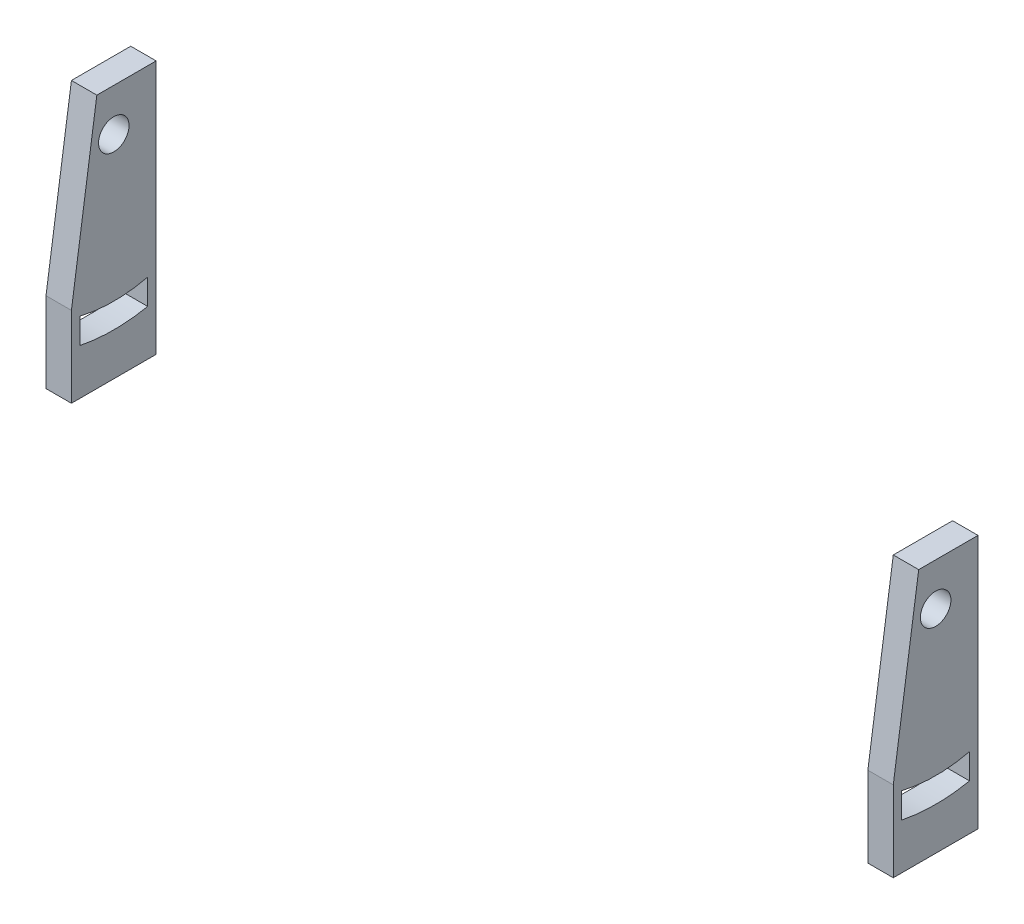
ISO-10303-21;
HEADER;
FILE_DESCRIPTION(('STEP AP214'),'2;1');
FILE_NAME('part.step','',(''),(''),'','','');
FILE_SCHEMA(('AUTOMOTIVE_DESIGN { 1 0 10303 214 1 1 1 1 }'));
ENDSEC;
DATA;
#1=APPLICATION_CONTEXT('core data for automotive mechanical design processes');
#2=APPLICATION_PROTOCOL_DEFINITION('international standard','automotive_design',2000,#1);
#3=PRODUCT_CONTEXT('',#1,'mechanical');
#4=PRODUCT('Part','Part','',(#3));
#5=PRODUCT_RELATED_PRODUCT_CATEGORY('part','',(#4));
#6=PRODUCT_DEFINITION_FORMATION('','',#4);
#7=PRODUCT_DEFINITION_CONTEXT('part definition',#1,'design');
#8=PRODUCT_DEFINITION('design','',#6,#7);
#9=PRODUCT_DEFINITION_SHAPE('','',#8);
#10=(LENGTH_UNIT() NAMED_UNIT(*) SI_UNIT(.MILLI.,.METRE.));
#11=(NAMED_UNIT(*) PLANE_ANGLE_UNIT() SI_UNIT($,.RADIAN.));
#12=(NAMED_UNIT(*) SI_UNIT($,.STERADIAN.) SOLID_ANGLE_UNIT());
#13=UNCERTAINTY_MEASURE_WITH_UNIT(LENGTH_MEASURE(1.E-05),#10,'distance_accuracy_value','');
#14=(GEOMETRIC_REPRESENTATION_CONTEXT(3) GLOBAL_UNCERTAINTY_ASSIGNED_CONTEXT((#13)) GLOBAL_UNIT_ASSIGNED_CONTEXT((#10,
#11,#12)) REPRESENTATION_CONTEXT('',''));
#15=CARTESIAN_POINT('',(0.,0.,0.));
#16=DIRECTION('',(0.,0.,1.));
#17=DIRECTION('',(1.,0.,0.));
#18=AXIS2_PLACEMENT_3D('',#15,#16,#17);
#19=CARTESIAN_POINT('',(100.,16.5321368936025,11.9084263256568));
#20=DIRECTION('',(0.,0.,-1.));
#21=DIRECTION('',(0.,1.,0.));
#22=AXIS2_PLACEMENT_3D('',#19,#20,#21);
#23=PLANE('',#22);
#24=DIRECTION('',(0.,1.,0.));
#25=VECTOR('',#24,1.);
#26=CARTESIAN_POINT('',(3.,-83.4678631063975,11.9084263256568));
#27=LINE('',#26,#25);
#28=CARTESIAN_POINT('',(3.,-13.4678631063975,11.9084263256568));
#29=VERTEX_POINT('',#28);
#30=CARTESIAN_POINT('',(3.,-3.96786310639754,11.9084263256568));
#31=VERTEX_POINT('',#30);
#32=EDGE_CURVE('E151',#29,#31,#27,.T.);
#33=ORIENTED_EDGE('',*,*,#32,.T.);
#34=DIRECTION('',(-1.,0.,0.));
#35=VECTOR('',#34,1.);
#36=CARTESIAN_POINT('',(100.,-3.9678631063975,11.9084263256568));
#37=LINE('',#36,#35);
#38=CARTESIAN_POINT('',(0.,-3.9678631063975,11.9084263256568));
#39=VERTEX_POINT('',#38);
#40=EDGE_CURVE('E57',#31,#39,#37,.T.);
#41=ORIENTED_EDGE('',*,*,#40,.T.);
#42=DIRECTION('',(0.,-1.,0.));
#43=VECTOR('',#42,1.);
#44=CARTESIAN_POINT('',(0.,16.5321368936025,11.9084263256568));
#45=LINE('',#44,#43);
#46=CARTESIAN_POINT('',(0.,-13.4678631063975,11.9084263256568));
#47=VERTEX_POINT('',#46);
#48=EDGE_CURVE('E127',#39,#47,#45,.T.);
#49=ORIENTED_EDGE('',*,*,#48,.T.);
#50=DIRECTION('',(-1.,0.,0.));
#51=VECTOR('',#50,1.);
#52=CARTESIAN_POINT('',(100.,-13.4678631063975,11.9084263256568));
#53=LINE('',#52,#51);
#54=EDGE_CURVE('E148',#29,#47,#53,.T.);
#55=ORIENTED_EDGE('',*,*,#54,.F.);
#56=EDGE_LOOP('',(#33,#41,#49,#55));
#57=FACE_BOUND('',#56,.T.);
#58=ADVANCED_FACE('F43',(#57),#23,.F.);
#59=CARTESIAN_POINT('',(100.,-13.4678631063975,11.9084263256568));
#60=DIRECTION('',(0.,1.,0.));
#61=DIRECTION('',(0.,0.,1.));
#62=AXIS2_PLACEMENT_3D('',#59,#60,#61);
#63=PLANE('',#62);
#64=DIRECTION('',(-1.,0.,0.));
#65=VECTOR('',#64,1.);
#66=CARTESIAN_POINT('',(100.,-13.4678631063975,1.90842632565675));
#67=LINE('',#66,#65);
#68=CARTESIAN_POINT('',(3.,-13.4678631063975,1.90842632565675));
#69=VERTEX_POINT('',#68);
#70=CARTESIAN_POINT('',(0.,-13.4678631063975,1.90842632565675));
#71=VERTEX_POINT('',#70);
#72=EDGE_CURVE('E144',#69,#71,#67,.T.);
#73=ORIENTED_EDGE('',*,*,#72,.F.);
#74=DIRECTION('',(0.,0.,1.));
#75=VECTOR('',#74,1.);
#76=CARTESIAN_POINT('',(3.,-13.4678631063975,11.9084263256568));
#77=LINE('',#76,#75);
#78=EDGE_CURVE('E150',#69,#29,#77,.T.);
#79=ORIENTED_EDGE('',*,*,#78,.T.);
#80=ORIENTED_EDGE('',*,*,#54,.T.);
#81=DIRECTION('',(0.,0.,-1.));
#82=VECTOR('',#81,1.);
#83=CARTESIAN_POINT('',(0.,-13.4678631063975,11.9084263256568));
#84=LINE('',#83,#82);
#85=EDGE_CURVE('E145',#47,#71,#84,.T.);
#86=ORIENTED_EDGE('',*,*,#85,.T.);
#87=EDGE_LOOP('',(#73,#79,#80,#86));
#88=FACE_BOUND('',#87,.T.);
#89=ADVANCED_FACE('F211',(#88),#63,.F.);
#90=CARTESIAN_POINT('',(100.,16.5321368936025,1.90842632565675));
#91=DIRECTION('',(0.,0.,1.));
#92=DIRECTION('',(1.,0.,0.));
#93=AXIS2_PLACEMENT_3D('',#90,#91,#92);
#94=PLANE('',#93);
#95=DIRECTION('',(-1.,0.,0.));
#96=VECTOR('',#95,1.);
#97=CARTESIAN_POINT('',(100.,16.5321368936025,1.90842632565675));
#98=LINE('',#97,#96);
#99=CARTESIAN_POINT('',(3.,16.5321368936025,1.90842632565675));
#100=VERTEX_POINT('',#99);
#101=CARTESIAN_POINT('',(0.,16.5321368936025,1.90842632565675));
#102=VERTEX_POINT('',#101);
#103=EDGE_CURVE('E131',#100,#102,#98,.T.);
#104=ORIENTED_EDGE('',*,*,#103,.F.);
#105=DIRECTION('',(0.,1.,0.));
#106=VECTOR('',#105,1.);
#107=CARTESIAN_POINT('',(3.,-83.4678631063975,1.90842632565675));
#108=LINE('',#107,#106);
#109=EDGE_CURVE('E133',#69,#100,#108,.T.);
#110=ORIENTED_EDGE('',*,*,#109,.F.);
#111=ORIENTED_EDGE('',*,*,#72,.T.);
#112=DIRECTION('',(0.,1.,0.));
#113=VECTOR('',#112,1.);
#114=CARTESIAN_POINT('',(0.,16.5321368936025,1.90842632565675));
#115=LINE('',#114,#113);
#116=EDGE_CURVE('E137',#71,#102,#115,.T.);
#117=ORIENTED_EDGE('',*,*,#116,.T.);
#118=EDGE_LOOP('',(#104,#110,#111,#117));
#119=FACE_BOUND('',#118,.T.);
#120=ADVANCED_FACE('F213',(#119),#94,.F.);
#121=CARTESIAN_POINT('',(100.,16.5321368936025,11.9084263256568));
#122=DIRECTION('',(0.,-1.,0.));
#123=DIRECTION('',(0.,0.,-1.));
#124=AXIS2_PLACEMENT_3D('',#121,#122,#123);
#125=PLANE('',#124);
#126=DIRECTION('',(0.,0.,1.));
#127=VECTOR('',#126,1.);
#128=CARTESIAN_POINT('',(0.,16.5321368936025,11.9084263256568));
#129=LINE('',#128,#127);
#130=CARTESIAN_POINT('',(0.,16.5321368936025,8.90842632565676));
#131=VERTEX_POINT('',#130);
#132=EDGE_CURVE('E125',#102,#131,#129,.T.);
#133=ORIENTED_EDGE('',*,*,#132,.T.);
#134=DIRECTION('',(-1.,0.,0.));
#135=VECTOR('',#134,1.);
#136=CARTESIAN_POINT('',(100.,16.5321368936025,8.90842632565676));
#137=LINE('',#136,#135);
#138=CARTESIAN_POINT('',(3.,16.5321368936025,8.90842632565676));
#139=VERTEX_POINT('',#138);
#140=EDGE_CURVE('E111',#139,#131,#137,.T.);
#141=ORIENTED_EDGE('',*,*,#140,.F.);
#142=DIRECTION('',(0.,0.,1.));
#143=VECTOR('',#142,1.);
#144=CARTESIAN_POINT('',(3.,16.5321368936025,11.9084263256568));
#145=LINE('',#144,#143);
#146=EDGE_CURVE('E135',#100,#139,#145,.T.);
#147=ORIENTED_EDGE('',*,*,#146,.F.);
#148=ORIENTED_EDGE('',*,*,#103,.T.);
#149=EDGE_LOOP('',(#133,#141,#147,#148));
#150=FACE_BOUND('',#149,.T.);
#151=ADVANCED_FACE('F129',(#150),#125,.F.);
#152=CARTESIAN_POINT('',(0.,0.,0.));
#153=DIRECTION('',(1.,0.,0.));
#154=DIRECTION('',(0.,0.,-1.));
#155=AXIS2_PLACEMENT_3D('',#152,#153,#154);
#156=PLANE('',#155);
#157=DIRECTION('',(0.,-1.,0.));
#158=VECTOR('',#157,1.);
#159=CARTESIAN_POINT('',(0.,-5.06378104866293,10.9084263256568));
#160=LINE('',#159,#158);
#161=CARTESIAN_POINT('',(0.,-5.06378104866293,10.9084263256567));
#162=VERTEX_POINT('',#161);
#163=CARTESIAN_POINT('',(0.,-8.06378104866293,10.9084263256568));
#164=VERTEX_POINT('',#163);
#165=EDGE_CURVE('E195',#162,#164,#160,.T.);
#166=ORIENTED_EDGE('',*,*,#165,.T.);
#167=CARTESIAN_POINT('',(0.,11.5321368936025,6.90842632565675));
#168=DIRECTION('',(1.,0.,0.));
#169=DIRECTION('',(0.,0.,1.));
#170=AXIS2_PLACEMENT_3D('',#167,#168,#169);
#171=CIRCLE('',#170,20.);
#172=CARTESIAN_POINT('',(0.,-8.06378104866293,2.90842632565675));
#173=VERTEX_POINT('',#172);
#174=EDGE_CURVE('E184',#164,#173,#171,.T.);
#175=ORIENTED_EDGE('',*,*,#174,.T.);
#176=DIRECTION('',(0.,0.99999967058035,0.000811689097765342));
#177=VECTOR('',#176,1.);
#178=CARTESIAN_POINT('',(0.,-5.06436765268107,2.91086091761197));
#179=LINE('',#178,#177);
#180=CARTESIAN_POINT('',(0.,-5.06436765268107,2.91086091761197));
#181=VERTEX_POINT('',#180);
#182=EDGE_CURVE('E200',#173,#181,#179,.T.);
#183=ORIENTED_EDGE('',*,*,#182,.T.);
#184=CARTESIAN_POINT('',(0.,11.5321368936025,6.90842632565675));
#185=DIRECTION('',(-1.,0.,0.));
#186=DIRECTION('',(0.,0.,1.));
#187=AXIS2_PLACEMENT_3D('',#184,#185,#186);
#188=CIRCLE('',#187,17.0711596661272);
#189=EDGE_CURVE('E64',#181,#162,#188,.T.);
#190=ORIENTED_EDGE('',*,*,#189,.T.);
#191=EDGE_LOOP('',(#166,#175,#183,#190));
#192=FACE_BOUND('',#191,.T.);
#193=CARTESIAN_POINT('',(0.,11.5321368936025,6.90842632565675));
#194=DIRECTION('',(1.,0.,0.));
#195=DIRECTION('',(0.,0.,-1.));
#196=AXIS2_PLACEMENT_3D('',#193,#194,#195);
#197=CIRCLE('',#196,1.80000000000045);
#198=CARTESIAN_POINT('',(0.,11.5321368936025,5.1084263256563));
#199=VERTEX_POINT('',#198);
#200=EDGE_CURVE('E141',#199,#199,#197,.T.);
#201=ORIENTED_EDGE('',*,*,#200,.T.);
#202=EDGE_LOOP('',(#201));
#203=FACE_BOUND('',#202,.T.);
#204=ORIENTED_EDGE('',*,*,#48,.F.);
#205=DIRECTION('',(0.,-0.989461064134103,0.144799180117186));
#206=VECTOR('',#205,1.);
#207=CARTESIAN_POINT('',(0.,16.5321368936025,8.90842632565676));
#208=LINE('',#207,#206);
#209=EDGE_CURVE('E114',#131,#39,#208,.T.);
#210=ORIENTED_EDGE('',*,*,#209,.F.);
#211=ORIENTED_EDGE('',*,*,#132,.F.);
#212=ORIENTED_EDGE('',*,*,#116,.F.);
#213=ORIENTED_EDGE('',*,*,#85,.F.);
#214=EDGE_LOOP('',(#204,#210,#211,#212,#213));
#215=FACE_BOUND('',#214,.T.);
#216=ADVANCED_FACE('F123',(#192,#203,#215),#156,.F.);
#217=CARTESIAN_POINT('',(3.,-83.4678631063975,11.9084263256568));
#218=DIRECTION('',(-1.,0.,0.));
#219=DIRECTION('',(0.,0.,1.));
#220=AXIS2_PLACEMENT_3D('',#217,#218,#219);
#221=PLANE('',#220);
#222=DIRECTION('',(0.,-0.99999967058035,-0.000811689097765342));
#223=VECTOR('',#222,1.);
#224=CARTESIAN_POINT('',(3.,-83.4605082277596,2.84722760403823));
#225=LINE('',#224,#223);
#226=CARTESIAN_POINT('',(3.,-5.06436765268107,2.91086091761197));
#227=VERTEX_POINT('',#226);
#228=CARTESIAN_POINT('',(3.,-8.06378104866293,2.90842632565675));
#229=VERTEX_POINT('',#228);
#230=EDGE_CURVE('E158',#227,#229,#225,.T.);
#231=ORIENTED_EDGE('',*,*,#230,.T.);
#232=CARTESIAN_POINT('',(3.,11.5321368936025,6.90842632565675));
#233=DIRECTION('',(-1.,0.,0.));
#234=DIRECTION('',(0.,0.,1.));
#235=AXIS2_PLACEMENT_3D('',#232,#233,#234);
#236=CIRCLE('',#235,20.);
#237=CARTESIAN_POINT('',(3.,-8.06378104866293,10.9084263256568));
#238=VERTEX_POINT('',#237);
#239=EDGE_CURVE('E50',#229,#238,#236,.T.);
#240=ORIENTED_EDGE('',*,*,#239,.T.);
#241=DIRECTION('',(0.,1.,0.));
#242=VECTOR('',#241,1.);
#243=CARTESIAN_POINT('',(3.,-83.4678631063975,10.9084263256568));
#244=LINE('',#243,#242);
#245=CARTESIAN_POINT('',(3.,-5.06378104866293,10.9084263256567));
#246=VERTEX_POINT('',#245);
#247=EDGE_CURVE('E169',#238,#246,#244,.T.);
#248=ORIENTED_EDGE('',*,*,#247,.T.);
#249=CARTESIAN_POINT('',(3.,11.5321368936025,6.90842632565675));
#250=DIRECTION('',(-1.,0.,0.));
#251=DIRECTION('',(0.,0.,1.));
#252=AXIS2_PLACEMENT_3D('',#249,#250,#251);
#253=CIRCLE('',#252,17.0711596661272);
#254=EDGE_CURVE('E166',#246,#227,#253,.F.);
#255=ORIENTED_EDGE('',*,*,#254,.T.);
#256=EDGE_LOOP('',(#231,#240,#248,#255));
#257=FACE_BOUND('',#256,.T.);
#258=CARTESIAN_POINT('',(3.,11.5321368936025,6.90842632565675));
#259=DIRECTION('',(-1.,0.,0.));
#260=DIRECTION('',(0.,0.,1.));
#261=AXIS2_PLACEMENT_3D('',#258,#259,#260);
#262=CIRCLE('',#261,1.80000000000045);
#263=CARTESIAN_POINT('',(3.,11.5321368936025,8.70842632565721));
#264=VERTEX_POINT('',#263);
#265=EDGE_CURVE('E155',#264,#264,#262,.T.);
#266=ORIENTED_EDGE('',*,*,#265,.T.);
#267=EDGE_LOOP('',(#266));
#268=FACE_BOUND('',#267,.T.);
#269=ORIENTED_EDGE('',*,*,#146,.T.);
#270=DIRECTION('',(0.,-0.989461064134103,0.144799180117186));
#271=VECTOR('',#270,1.);
#272=CARTESIAN_POINT('',(3.,-81.8010023026701,23.2986418177942));
#273=LINE('',#272,#271);
#274=EDGE_CURVE('E12',#139,#31,#273,.T.);
#275=ORIENTED_EDGE('',*,*,#274,.T.);
#276=ORIENTED_EDGE('',*,*,#32,.F.);
#277=ORIENTED_EDGE('',*,*,#78,.F.);
#278=ORIENTED_EDGE('',*,*,#109,.T.);
#279=EDGE_LOOP('',(#269,#275,#276,#277,#278));
#280=FACE_BOUND('',#279,.T.);
#281=ADVANCED_FACE('F174',(#257,#268,#280),#221,.F.);
#282=CARTESIAN_POINT('',(0.,11.5321368936025,6.90842632565675));
#283=DIRECTION('',(1.,0.,0.));
#284=DIRECTION('',(0.,0.,-1.));
#285=AXIS2_PLACEMENT_3D('',#282,#283,#284);
#286=CYLINDRICAL_SURFACE('',#285,1.80000000000045);
#287=ORIENTED_EDGE('',*,*,#200,.F.);
#288=EDGE_LOOP('',(#287));
#289=FACE_BOUND('',#288,.T.);
#290=ORIENTED_EDGE('',*,*,#265,.F.);
#291=EDGE_LOOP('',(#290));
#292=FACE_BOUND('',#291,.T.);
#293=ADVANCED_FACE('F240',(#289,#292),#286,.F.);
#294=CARTESIAN_POINT('',(0.,11.5321368936025,6.90842632565675));
#295=DIRECTION('',(1.,0.,0.));
#296=DIRECTION('',(0.,0.,-1.));
#297=AXIS2_PLACEMENT_3D('',#294,#295,#296);
#298=CYLINDRICAL_SURFACE('',#297,20.);
#299=DIRECTION('',(1.,0.,0.));
#300=VECTOR('',#299,1.);
#301=CARTESIAN_POINT('',(0.,-8.06378104866293,2.90842632565675));
#302=LINE('',#301,#300);
#303=EDGE_CURVE('E180',#173,#229,#302,.T.);
#304=ORIENTED_EDGE('',*,*,#303,.F.);
#305=ORIENTED_EDGE('',*,*,#174,.F.);
#306=DIRECTION('',(1.,0.,0.));
#307=VECTOR('',#306,1.);
#308=CARTESIAN_POINT('',(0.,-8.06378104866293,10.9084263256568));
#309=LINE('',#308,#307);
#310=EDGE_CURVE('E182',#164,#238,#309,.T.);
#311=ORIENTED_EDGE('',*,*,#310,.T.);
#312=ORIENTED_EDGE('',*,*,#239,.F.);
#313=EDGE_LOOP('',(#304,#305,#311,#312));
#314=FACE_BOUND('',#313,.T.);
#315=ADVANCED_FACE('F178',(#314),#298,.F.);
#316=CARTESIAN_POINT('',(0.,-5.06378104866293,10.9084263256568));
#317=DIRECTION('',(0.,0.,1.));
#318=DIRECTION('',(1.,0.,0.));
#319=AXIS2_PLACEMENT_3D('',#316,#317,#318);
#320=PLANE('',#319);
#321=ORIENTED_EDGE('',*,*,#310,.F.);
#322=ORIENTED_EDGE('',*,*,#165,.F.);
#323=DIRECTION('',(1.,0.,0.));
#324=VECTOR('',#323,1.);
#325=CARTESIAN_POINT('',(0.,-5.06378104866293,10.9084263256567));
#326=LINE('',#325,#324);
#327=EDGE_CURVE('E188',#162,#246,#326,.T.);
#328=ORIENTED_EDGE('',*,*,#327,.T.);
#329=ORIENTED_EDGE('',*,*,#247,.F.);
#330=EDGE_LOOP('',(#321,#322,#328,#329));
#331=FACE_BOUND('',#330,.T.);
#332=ADVANCED_FACE('F256',(#331),#320,.F.);
#333=CARTESIAN_POINT('',(0.,11.5321368936025,6.90842632565675));
#334=DIRECTION('',(1.,0.,0.));
#335=DIRECTION('',(0.,0.,-1.));
#336=AXIS2_PLACEMENT_3D('',#333,#334,#335);
#337=CYLINDRICAL_SURFACE('',#336,17.0711596661272);
#338=ORIENTED_EDGE('',*,*,#327,.F.);
#339=ORIENTED_EDGE('',*,*,#189,.F.);
#340=DIRECTION('',(1.,0.,0.));
#341=VECTOR('',#340,1.);
#342=CARTESIAN_POINT('',(0.,-5.06436765268107,2.91086091761197));
#343=LINE('',#342,#341);
#344=EDGE_CURVE('E192',#181,#227,#343,.T.);
#345=ORIENTED_EDGE('',*,*,#344,.T.);
#346=ORIENTED_EDGE('',*,*,#254,.F.);
#347=EDGE_LOOP('',(#338,#339,#345,#346));
#348=FACE_BOUND('',#347,.T.);
#349=ADVANCED_FACE('F265',(#348),#337,.T.);
#350=CARTESIAN_POINT('',(0.,-5.06436765268107,2.91086091761197));
#351=DIRECTION('',(0.,0.000811689097765342,-0.99999967058035));
#352=DIRECTION('',(0.,0.99999967058035,0.000811689097765342));
#353=AXIS2_PLACEMENT_3D('',#350,#351,#352);
#354=PLANE('',#353);
#355=ORIENTED_EDGE('',*,*,#344,.F.);
#356=ORIENTED_EDGE('',*,*,#182,.F.);
#357=ORIENTED_EDGE('',*,*,#303,.T.);
#358=ORIENTED_EDGE('',*,*,#230,.F.);
#359=EDGE_LOOP('',(#355,#356,#357,#358));
#360=FACE_BOUND('',#359,.T.);
#361=ADVANCED_FACE('F273',(#360),#354,.F.);
#362=CARTESIAN_POINT('',(100.,16.5321368936025,8.90842632565676));
#363=DIRECTION('',(0.,-0.144799180117186,-0.989461064134103));
#364=DIRECTION('',(0.,0.989461064134103,-0.144799180117186));
#365=AXIS2_PLACEMENT_3D('',#362,#363,#364);
#366=PLANE('',#365);
#367=ORIENTED_EDGE('',*,*,#140,.T.);
#368=ORIENTED_EDGE('',*,*,#209,.T.);
#369=ORIENTED_EDGE('',*,*,#40,.F.);
#370=ORIENTED_EDGE('',*,*,#274,.F.);
#371=EDGE_LOOP('',(#367,#368,#369,#370));
#372=FACE_BOUND('',#371,.T.);
#373=ADVANCED_FACE('F113',(#372),#366,.F.);
#374=CLOSED_SHELL('',(#58,#89,#120,#151,#216,#281,#293,#315,#332,#349,#361,#373));
#375=MANIFOLD_SOLID_BREP('B2',#374);
#376=CARTESIAN_POINT('',(100.,0.,0.));
#377=DIRECTION('',(1.,0.,0.));
#378=DIRECTION('',(0.,0.,-1.));
#379=AXIS2_PLACEMENT_3D('',#376,#377,#378);
#380=PLANE('',#379);
#381=DIRECTION('',(0.,-0.989461064134103,0.144799180117186));
#382=VECTOR('',#381,1.);
#383=CARTESIAN_POINT('',(100.,16.5321368936025,8.90842632565676));
#384=LINE('',#383,#382);
#385=CARTESIAN_POINT('',(100.,16.5321368936025,8.90842632565676));
#386=VERTEX_POINT('',#385);
#387=CARTESIAN_POINT('',(100.,-3.9678631063975,11.9084263256568));
#388=VERTEX_POINT('',#387);
#389=EDGE_CURVE('E389',#386,#388,#384,.T.);
#390=ORIENTED_EDGE('',*,*,#389,.T.);
#391=DIRECTION('',(0.,-1.,0.));
#392=VECTOR('',#391,1.);
#393=CARTESIAN_POINT('',(100.,16.5321368936025,11.9084263256568));
#394=LINE('',#393,#392);
#395=CARTESIAN_POINT('',(100.,-13.4678631063975,11.9084263256568));
#396=VERTEX_POINT('',#395);
#397=EDGE_CURVE('E469',#388,#396,#394,.T.);
#398=ORIENTED_EDGE('',*,*,#397,.T.);
#399=DIRECTION('',(0.,0.,-1.));
#400=VECTOR('',#399,1.);
#401=CARTESIAN_POINT('',(100.,-13.4678631063975,11.9084263256568));
#402=LINE('',#401,#400);
#403=CARTESIAN_POINT('',(100.,-13.4678631063975,1.90842632565675));
#404=VERTEX_POINT('',#403);
#405=EDGE_CURVE('E413',#396,#404,#402,.T.);
#406=ORIENTED_EDGE('',*,*,#405,.T.);
#407=DIRECTION('',(0.,1.,0.));
#408=VECTOR('',#407,1.);
#409=CARTESIAN_POINT('',(100.,16.5321368936025,1.90842632565675));
#410=LINE('',#409,#408);
#411=CARTESIAN_POINT('',(100.,16.5321368936025,1.90842632565675));
#412=VERTEX_POINT('',#411);
#413=EDGE_CURVE('E407',#404,#412,#410,.T.);
#414=ORIENTED_EDGE('',*,*,#413,.T.);
#415=DIRECTION('',(0.,0.,1.));
#416=VECTOR('',#415,1.);
#417=CARTESIAN_POINT('',(100.,16.5321368936025,11.9084263256568));
#418=LINE('',#417,#416);
#419=EDGE_CURVE('E402',#412,#386,#418,.T.);
#420=ORIENTED_EDGE('',*,*,#419,.T.);
#421=EDGE_LOOP('',(#390,#398,#406,#414,#420));
#422=FACE_BOUND('',#421,.T.);
#423=CARTESIAN_POINT('',(100.,11.5321368936025,6.90842632565675));
#424=DIRECTION('',(1.,0.,0.));
#425=DIRECTION('',(0.,0.,1.));
#426=AXIS2_PLACEMENT_3D('',#423,#424,#425);
#427=CIRCLE('',#426,20.);
#428=CARTESIAN_POINT('',(100.,-8.06378104866293,10.9084263256568));
#429=VERTEX_POINT('',#428);
#430=CARTESIAN_POINT('',(100.,-8.06378104866293,2.90842632565675));
#431=VERTEX_POINT('',#430);
#432=EDGE_CURVE('E342',#429,#431,#427,.T.);
#433=ORIENTED_EDGE('',*,*,#432,.F.);
#434=DIRECTION('',(0.,-1.,0.));
#435=VECTOR('',#434,1.);
#436=CARTESIAN_POINT('',(100.,-5.06378104866293,10.9084263256568));
#437=LINE('',#436,#435);
#438=CARTESIAN_POINT('',(100.,-5.06378104866293,10.9084263256567));
#439=VERTEX_POINT('',#438);
#440=EDGE_CURVE('E447',#439,#429,#437,.T.);
#441=ORIENTED_EDGE('',*,*,#440,.F.);
#442=CARTESIAN_POINT('',(100.,11.5321368936025,6.90842632565675));
#443=DIRECTION('',(-1.,0.,0.));
#444=DIRECTION('',(0.,0.,1.));
#445=AXIS2_PLACEMENT_3D('',#442,#443,#444);
#446=CIRCLE('',#445,17.0711596661272);
#447=CARTESIAN_POINT('',(100.,-5.06436765268107,2.91086091761197));
#448=VERTEX_POINT('',#447);
#449=EDGE_CURVE('E485',#448,#439,#446,.T.);
#450=ORIENTED_EDGE('',*,*,#449,.F.);
#451=DIRECTION('',(0.,0.99999967058035,0.000811689097765342));
#452=VECTOR('',#451,1.);
#453=CARTESIAN_POINT('',(100.,-5.06436765268107,2.91086091761197));
#454=LINE('',#453,#452);
#455=EDGE_CURVE('E481',#431,#448,#454,.T.);
#456=ORIENTED_EDGE('',*,*,#455,.F.);
#457=EDGE_LOOP('',(#433,#441,#450,#456));
#458=FACE_BOUND('',#457,.T.);
#459=CARTESIAN_POINT('',(100.,11.5321368936025,6.90842632565675));
#460=DIRECTION('',(1.,0.,0.));
#461=DIRECTION('',(0.,0.,-1.));
#462=AXIS2_PLACEMENT_3D('',#459,#460,#461);
#463=CIRCLE('',#462,1.80000000000045);
#464=CARTESIAN_POINT('',(100.,11.5321368936025,5.1084263256563));
#465=VERTEX_POINT('',#464);
#466=EDGE_CURVE('E426',#465,#465,#463,.T.);
#467=ORIENTED_EDGE('',*,*,#466,.F.);
#468=EDGE_LOOP('',(#467));
#469=FACE_BOUND('',#468,.T.);
#470=ADVANCED_FACE('F320',(#422,#458,#469),#380,.T.);
#471=CARTESIAN_POINT('',(100.,16.5321368936025,11.9084263256568));
#472=DIRECTION('',(0.,-1.,0.));
#473=DIRECTION('',(0.,0.,-1.));
#474=AXIS2_PLACEMENT_3D('',#471,#472,#473);
#475=PLANE('',#474);
#476=DIRECTION('',(0.,0.,-1.));
#477=VECTOR('',#476,1.);
#478=CARTESIAN_POINT('',(97.,16.5321368936025,11.9084263256568));
#479=LINE('',#478,#477);
#480=CARTESIAN_POINT('',(97.,16.5321368936025,8.90842632565675));
#481=VERTEX_POINT('',#480);
#482=CARTESIAN_POINT('',(97.,16.5321368936025,1.90842632565675));
#483=VERTEX_POINT('',#482);
#484=EDGE_CURVE('E403',#481,#483,#479,.T.);
#485=ORIENTED_EDGE('',*,*,#484,.F.);
#486=DIRECTION('',(-1.,0.,0.));
#487=VECTOR('',#486,1.);
#488=CARTESIAN_POINT('',(100.,16.5321368936025,8.90842632565676));
#489=LINE('',#488,#487);
#490=EDGE_CURVE('E335',#386,#481,#489,.T.);
#491=ORIENTED_EDGE('',*,*,#490,.F.);
#492=ORIENTED_EDGE('',*,*,#419,.F.);
#493=DIRECTION('',(-1.,0.,0.));
#494=VECTOR('',#493,1.);
#495=CARTESIAN_POINT('',(100.,16.5321368936025,1.90842632565675));
#496=LINE('',#495,#494);
#497=EDGE_CURVE('E409',#412,#483,#496,.T.);
#498=ORIENTED_EDGE('',*,*,#497,.T.);
#499=EDGE_LOOP('',(#485,#491,#492,#498));
#500=FACE_BOUND('',#499,.T.);
#501=ADVANCED_FACE('F400',(#500),#475,.F.);
#502=CARTESIAN_POINT('',(100.,16.5321368936025,1.90842632565675));
#503=DIRECTION('',(0.,0.,1.));
#504=DIRECTION('',(1.,0.,0.));
#505=AXIS2_PLACEMENT_3D('',#502,#503,#504);
#506=PLANE('',#505);
#507=DIRECTION('',(-1.,0.,0.));
#508=VECTOR('',#507,1.);
#509=CARTESIAN_POINT('',(100.,-13.4678631063975,1.90842632565675));
#510=LINE('',#509,#508);
#511=CARTESIAN_POINT('',(97.,-13.4678631063975,1.90842632565675));
#512=VERTEX_POINT('',#511);
#513=EDGE_CURVE('E411',#404,#512,#510,.T.);
#514=ORIENTED_EDGE('',*,*,#513,.T.);
#515=DIRECTION('',(0.,1.,0.));
#516=VECTOR('',#515,1.);
#517=CARTESIAN_POINT('',(97.,-83.4678631063975,1.90842632565675));
#518=LINE('',#517,#516);
#519=EDGE_CURVE('E461',#512,#483,#518,.T.);
#520=ORIENTED_EDGE('',*,*,#519,.T.);
#521=ORIENTED_EDGE('',*,*,#497,.F.);
#522=ORIENTED_EDGE('',*,*,#413,.F.);
#523=EDGE_LOOP('',(#514,#520,#521,#522));
#524=FACE_BOUND('',#523,.T.);
#525=ADVANCED_FACE('F476',(#524),#506,.F.);
#526=CARTESIAN_POINT('',(100.,-13.4678631063975,11.9084263256568));
#527=DIRECTION('',(0.,1.,0.));
#528=DIRECTION('',(0.,0.,1.));
#529=AXIS2_PLACEMENT_3D('',#526,#527,#528);
#530=PLANE('',#529);
#531=DIRECTION('',(-1.,0.,0.));
#532=VECTOR('',#531,1.);
#533=CARTESIAN_POINT('',(100.,-13.4678631063975,11.9084263256568));
#534=LINE('',#533,#532);
#535=CARTESIAN_POINT('',(97.,-13.4678631063975,11.9084263256568));
#536=VERTEX_POINT('',#535);
#537=EDGE_CURVE('E419',#396,#536,#534,.T.);
#538=ORIENTED_EDGE('',*,*,#537,.T.);
#539=DIRECTION('',(0.,0.,-1.));
#540=VECTOR('',#539,1.);
#541=CARTESIAN_POINT('',(97.,-13.4678631063975,11.9084263256568));
#542=LINE('',#541,#540);
#543=EDGE_CURVE('E464',#536,#512,#542,.T.);
#544=ORIENTED_EDGE('',*,*,#543,.T.);
#545=ORIENTED_EDGE('',*,*,#513,.F.);
#546=ORIENTED_EDGE('',*,*,#405,.F.);
#547=EDGE_LOOP('',(#538,#544,#545,#546));
#548=FACE_BOUND('',#547,.T.);
#549=ADVANCED_FACE('F474',(#548),#530,.F.);
#550=CARTESIAN_POINT('',(100.,16.5321368936025,11.9084263256568));
#551=DIRECTION('',(0.,0.,-1.));
#552=DIRECTION('',(0.,1.,0.));
#553=AXIS2_PLACEMENT_3D('',#550,#551,#552);
#554=PLANE('',#553);
#555=ORIENTED_EDGE('',*,*,#397,.F.);
#556=DIRECTION('',(-1.,0.,0.));
#557=VECTOR('',#556,1.);
#558=CARTESIAN_POINT('',(100.,-3.9678631063975,11.9084263256568));
#559=LINE('',#558,#557);
#560=CARTESIAN_POINT('',(97.,-3.9678631063975,11.9084263256568));
#561=VERTEX_POINT('',#560);
#562=EDGE_CURVE('E392',#388,#561,#559,.T.);
#563=ORIENTED_EDGE('',*,*,#562,.T.);
#564=DIRECTION('',(0.,1.,0.));
#565=VECTOR('',#564,1.);
#566=CARTESIAN_POINT('',(97.,-83.4678631063975,11.9084263256568));
#567=LINE('',#566,#565);
#568=EDGE_CURVE('E460',#536,#561,#567,.T.);
#569=ORIENTED_EDGE('',*,*,#568,.F.);
#570=ORIENTED_EDGE('',*,*,#537,.F.);
#571=EDGE_LOOP('',(#555,#563,#569,#570));
#572=FACE_BOUND('',#571,.T.);
#573=ADVANCED_FACE('F322',(#572),#554,.F.);
#574=CARTESIAN_POINT('',(97.,-83.4678631063975,11.9084263256568));
#575=DIRECTION('',(1.,0.,0.));
#576=DIRECTION('',(0.,0.,-1.));
#577=AXIS2_PLACEMENT_3D('',#574,#575,#576);
#578=PLANE('',#577);
#579=DIRECTION('',(0.,-1.,0.));
#580=VECTOR('',#579,1.);
#581=CARTESIAN_POINT('',(97.,-83.4678631063975,10.9084263256568));
#582=LINE('',#581,#580);
#583=CARTESIAN_POINT('',(97.,-5.06378104866293,10.9084263256567));
#584=VERTEX_POINT('',#583);
#585=CARTESIAN_POINT('',(97.,-8.06378104866293,10.9084263256568));
#586=VERTEX_POINT('',#585);
#587=EDGE_CURVE('E432',#584,#586,#582,.T.);
#588=ORIENTED_EDGE('',*,*,#587,.T.);
#589=CARTESIAN_POINT('',(97.,11.5321368936025,6.90842632565675));
#590=DIRECTION('',(1.,0.,0.));
#591=DIRECTION('',(0.,0.,-1.));
#592=AXIS2_PLACEMENT_3D('',#589,#590,#591);
#593=CIRCLE('',#592,20.);
#594=CARTESIAN_POINT('',(97.,-8.06378104866293,2.90842632565675));
#595=VERTEX_POINT('',#594);
#596=EDGE_CURVE('E328',#586,#595,#593,.T.);
#597=ORIENTED_EDGE('',*,*,#596,.T.);
#598=DIRECTION('',(0.,0.99999967058035,0.000811689097765342));
#599=VECTOR('',#598,1.);
#600=CARTESIAN_POINT('',(97.,-83.4605082277596,2.84722760403823));
#601=LINE('',#600,#599);
#602=CARTESIAN_POINT('',(97.,-5.06436765268108,2.91086091761196));
#603=VERTEX_POINT('',#602);
#604=EDGE_CURVE('E422',#595,#603,#601,.T.);
#605=ORIENTED_EDGE('',*,*,#604,.T.);
#606=CARTESIAN_POINT('',(97.,11.5321368936025,6.90842632565675));
#607=DIRECTION('',(1.,0.,0.));
#608=DIRECTION('',(0.,0.,-1.));
#609=AXIS2_PLACEMENT_3D('',#606,#607,#608);
#610=CIRCLE('',#609,17.0711596661272);
#611=EDGE_CURVE('E429',#603,#584,#610,.F.);
#612=ORIENTED_EDGE('',*,*,#611,.T.);
#613=EDGE_LOOP('',(#588,#597,#605,#612));
#614=FACE_BOUND('',#613,.T.);
#615=CARTESIAN_POINT('',(97.,11.5321368936025,6.90842632565675));
#616=DIRECTION('',(1.,0.,0.));
#617=DIRECTION('',(0.,0.,-1.));
#618=AXIS2_PLACEMENT_3D('',#615,#616,#617);
#619=CIRCLE('',#618,1.80000000000045);
#620=CARTESIAN_POINT('',(97.,11.5321368936025,5.1084263256563));
#621=VERTEX_POINT('',#620);
#622=EDGE_CURVE('E423',#621,#621,#619,.T.);
#623=ORIENTED_EDGE('',*,*,#622,.T.);
#624=EDGE_LOOP('',(#623));
#625=FACE_BOUND('',#624,.T.);
#626=ORIENTED_EDGE('',*,*,#568,.T.);
#627=DIRECTION('',(0.,0.989461064134103,-0.144799180117186));
#628=VECTOR('',#627,1.);
#629=CARTESIAN_POINT('',(97.,-81.8010023026701,23.2986418177942));
#630=LINE('',#629,#628);
#631=EDGE_CURVE('E41',#561,#481,#630,.T.);
#632=ORIENTED_EDGE('',*,*,#631,.T.);
#633=ORIENTED_EDGE('',*,*,#484,.T.);
#634=ORIENTED_EDGE('',*,*,#519,.F.);
#635=ORIENTED_EDGE('',*,*,#543,.F.);
#636=EDGE_LOOP('',(#626,#632,#633,#634,#635));
#637=FACE_BOUND('',#636,.T.);
#638=ADVANCED_FACE('F436',(#614,#625,#637),#578,.F.);
#639=CARTESIAN_POINT('',(0.,11.5321368936025,6.90842632565675));
#640=DIRECTION('',(1.,0.,0.));
#641=DIRECTION('',(0.,0.,-1.));
#642=AXIS2_PLACEMENT_3D('',#639,#640,#641);
#643=CYLINDRICAL_SURFACE('',#642,1.80000000000045);
#644=ORIENTED_EDGE('',*,*,#466,.T.);
#645=EDGE_LOOP('',(#644));
#646=FACE_BOUND('',#645,.T.);
#647=ORIENTED_EDGE('',*,*,#622,.F.);
#648=EDGE_LOOP('',(#647));
#649=FACE_BOUND('',#648,.T.);
#650=ADVANCED_FACE('F521',(#646,#649),#643,.F.);
#651=CARTESIAN_POINT('',(0.,11.5321368936025,6.90842632565675));
#652=DIRECTION('',(1.,0.,0.));
#653=DIRECTION('',(0.,0.,-1.));
#654=AXIS2_PLACEMENT_3D('',#651,#652,#653);
#655=CYLINDRICAL_SURFACE('',#654,20.);
#656=DIRECTION('',(1.,0.,0.));
#657=VECTOR('',#656,1.);
#658=CARTESIAN_POINT('',(0.,-8.06378104866293,10.9084263256568));
#659=LINE('',#658,#657);
#660=EDGE_CURVE('E440',#586,#429,#659,.T.);
#661=ORIENTED_EDGE('',*,*,#660,.T.);
#662=ORIENTED_EDGE('',*,*,#432,.T.);
#663=DIRECTION('',(1.,0.,0.));
#664=VECTOR('',#663,1.);
#665=CARTESIAN_POINT('',(0.,-8.06378104866293,2.90842632565675));
#666=LINE('',#665,#664);
#667=EDGE_CURVE('E442',#595,#431,#666,.T.);
#668=ORIENTED_EDGE('',*,*,#667,.F.);
#669=ORIENTED_EDGE('',*,*,#596,.F.);
#670=EDGE_LOOP('',(#661,#662,#668,#669));
#671=FACE_BOUND('',#670,.T.);
#672=ADVANCED_FACE('F439',(#671),#655,.F.);
#673=CARTESIAN_POINT('',(0.,-5.06378104866293,10.9084263256568));
#674=DIRECTION('',(0.,0.,1.));
#675=DIRECTION('',(1.,0.,0.));
#676=AXIS2_PLACEMENT_3D('',#673,#674,#675);
#677=PLANE('',#676);
#678=DIRECTION('',(1.,0.,0.));
#679=VECTOR('',#678,1.);
#680=CARTESIAN_POINT('',(0.,-5.06378104866293,10.9084263256567));
#681=LINE('',#680,#679);
#682=EDGE_CURVE('E448',#584,#439,#681,.T.);
#683=ORIENTED_EDGE('',*,*,#682,.T.);
#684=ORIENTED_EDGE('',*,*,#440,.T.);
#685=ORIENTED_EDGE('',*,*,#660,.F.);
#686=ORIENTED_EDGE('',*,*,#587,.F.);
#687=EDGE_LOOP('',(#683,#684,#685,#686));
#688=FACE_BOUND('',#687,.T.);
#689=ADVANCED_FACE('F444',(#688),#677,.F.);
#690=CARTESIAN_POINT('',(0.,11.5321368936025,6.90842632565675));
#691=DIRECTION('',(1.,0.,0.));
#692=DIRECTION('',(0.,0.,-1.));
#693=AXIS2_PLACEMENT_3D('',#690,#691,#692);
#694=CYLINDRICAL_SURFACE('',#693,17.0711596661272);
#695=DIRECTION('',(1.,0.,0.));
#696=VECTOR('',#695,1.);
#697=CARTESIAN_POINT('',(0.,-5.06436765268107,2.91086091761197));
#698=LINE('',#697,#696);
#699=EDGE_CURVE('E452',#603,#448,#698,.T.);
#700=ORIENTED_EDGE('',*,*,#699,.T.);
#701=ORIENTED_EDGE('',*,*,#449,.T.);
#702=ORIENTED_EDGE('',*,*,#682,.F.);
#703=ORIENTED_EDGE('',*,*,#611,.F.);
#704=EDGE_LOOP('',(#700,#701,#702,#703));
#705=FACE_BOUND('',#704,.T.);
#706=ADVANCED_FACE('F489',(#705),#694,.T.);
#707=CARTESIAN_POINT('',(0.,-5.06436765268107,2.91086091761197));
#708=DIRECTION('',(0.,0.000811689097765342,-0.99999967058035));
#709=DIRECTION('',(0.,0.99999967058035,0.000811689097765342));
#710=AXIS2_PLACEMENT_3D('',#707,#708,#709);
#711=PLANE('',#710);
#712=ORIENTED_EDGE('',*,*,#667,.T.);
#713=ORIENTED_EDGE('',*,*,#455,.T.);
#714=ORIENTED_EDGE('',*,*,#699,.F.);
#715=ORIENTED_EDGE('',*,*,#604,.F.);
#716=EDGE_LOOP('',(#712,#713,#714,#715));
#717=FACE_BOUND('',#716,.T.);
#718=ADVANCED_FACE('F494',(#717),#711,.F.);
#719=CARTESIAN_POINT('',(100.,16.5321368936025,8.90842632565676));
#720=DIRECTION('',(0.,-0.144799180117186,-0.989461064134103));
#721=DIRECTION('',(0.,0.989461064134103,-0.144799180117186));
#722=AXIS2_PLACEMENT_3D('',#719,#720,#721);
#723=PLANE('',#722);
#724=ORIENTED_EDGE('',*,*,#562,.F.);
#725=ORIENTED_EDGE('',*,*,#389,.F.);
#726=ORIENTED_EDGE('',*,*,#490,.T.);
#727=ORIENTED_EDGE('',*,*,#631,.F.);
#728=EDGE_LOOP('',(#724,#725,#726,#727));
#729=FACE_BOUND('',#728,.T.);
#730=ADVANCED_FACE('F390',(#729),#723,.F.);
#731=CLOSED_SHELL('',(#470,#501,#525,#549,#573,#638,#650,#672,#689,#706,#718,#730));
#732=MANIFOLD_SOLID_BREP('B6',#731);
#733=ADVANCED_BREP_SHAPE_REPRESENTATION('',(#18,#375,#732),#14);
#734=SHAPE_DEFINITION_REPRESENTATION(#9,#733);
ENDSEC;
END-ISO-10303-21;
